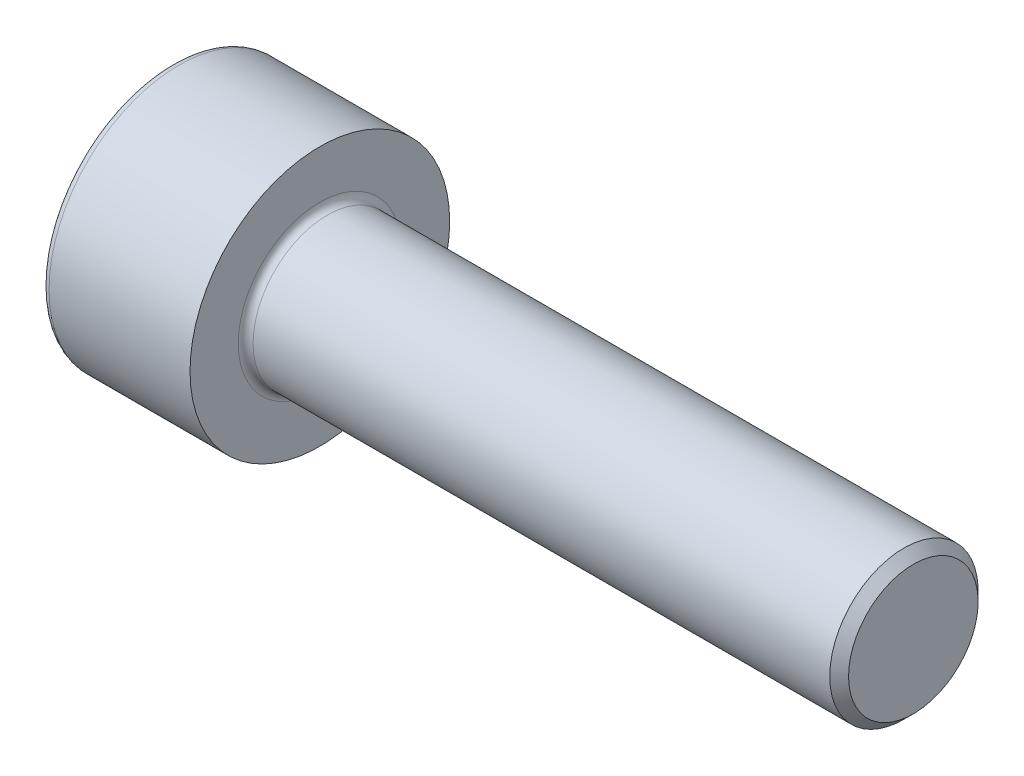
ISO-10303-21;
HEADER;
FILE_DESCRIPTION(('STEP AP214'),'2;1');
FILE_NAME('part.step','',(''),(''),'','','');
FILE_SCHEMA(('AUTOMOTIVE_DESIGN { 1 0 10303 214 1 1 1 1 }'));
ENDSEC;
DATA;
#1=APPLICATION_CONTEXT('core data for automotive mechanical design processes');
#2=APPLICATION_PROTOCOL_DEFINITION('international standard','automotive_design',2000,#1);
#3=PRODUCT_CONTEXT('',#1,'mechanical');
#4=PRODUCT('Part','Part','',(#3));
#5=PRODUCT_RELATED_PRODUCT_CATEGORY('part','',(#4));
#6=PRODUCT_DEFINITION_FORMATION('','',#4);
#7=PRODUCT_DEFINITION_CONTEXT('part definition',#1,'design');
#8=PRODUCT_DEFINITION('design','',#6,#7);
#9=PRODUCT_DEFINITION_SHAPE('','',#8);
#10=(LENGTH_UNIT() NAMED_UNIT(*) SI_UNIT(.MILLI.,.METRE.));
#11=(NAMED_UNIT(*) PLANE_ANGLE_UNIT() SI_UNIT($,.RADIAN.));
#12=(NAMED_UNIT(*) SI_UNIT($,.STERADIAN.) SOLID_ANGLE_UNIT());
#13=UNCERTAINTY_MEASURE_WITH_UNIT(LENGTH_MEASURE(1.E-05),#10,'distance_accuracy_value','');
#14=(GEOMETRIC_REPRESENTATION_CONTEXT(3) GLOBAL_UNCERTAINTY_ASSIGNED_CONTEXT((#13)) GLOBAL_UNIT_ASSIGNED_CONTEXT((#10,
#11,#12)) REPRESENTATION_CONTEXT('',''));
#15=CARTESIAN_POINT('',(0.,0.,0.));
#16=DIRECTION('',(0.,0.,1.));
#17=DIRECTION('',(1.,0.,0.));
#18=AXIS2_PLACEMENT_3D('',#15,#16,#17);
#19=CARTESIAN_POINT('',(16.,0.,0.));
#20=DIRECTION('',(-1.,0.,0.));
#21=DIRECTION('',(0.,0.,1.));
#22=AXIS2_PLACEMENT_3D('',#19,#20,#21);
#23=CONICAL_SURFACE('',#22,1.7464999999935,0.785398163397448);
#24=CARTESIAN_POINT('',(15.7464999999935,0.,0.));
#25=DIRECTION('',(-1.,0.,0.));
#26=DIRECTION('',(0.,0.,1.));
#27=AXIS2_PLACEMENT_3D('',#24,#25,#26);
#28=CIRCLE('',#27,2.);
#29=CARTESIAN_POINT('',(15.7464999999935,0.,2.));
#30=VERTEX_POINT('',#29);
#31=EDGE_CURVE('E11',#30,#30,#28,.T.);
#32=ORIENTED_EDGE('',*,*,#31,.F.);
#33=EDGE_LOOP('',(#32));
#34=FACE_BOUND('',#33,.T.);
#35=CARTESIAN_POINT('',(16.,0.,0.));
#36=DIRECTION('',(-1.,0.,0.));
#37=DIRECTION('',(0.,0.,1.));
#38=AXIS2_PLACEMENT_3D('',#35,#36,#37);
#39=CIRCLE('',#38,1.7464999999935);
#40=CARTESIAN_POINT('',(16.,0.,1.7464999999935));
#41=VERTEX_POINT('',#40);
#42=EDGE_CURVE('E134',#41,#41,#39,.T.);
#43=ORIENTED_EDGE('',*,*,#42,.T.);
#44=EDGE_LOOP('',(#43));
#45=FACE_BOUND('',#44,.T.);
#46=ADVANCED_FACE('F33',(#34,#45),#23,.T.);
#47=CARTESIAN_POINT('',(-4.,0.,0.));
#48=DIRECTION('',(-1.,0.,0.));
#49=DIRECTION('',(0.,0.,1.));
#50=AXIS2_PLACEMENT_3D('',#47,#48,#49);
#51=CYLINDRICAL_SURFACE('',#50,2.);
#52=CARTESIAN_POINT('',(0.200000000000001,0.,0.));
#53=DIRECTION('',(-1.,0.,0.));
#54=DIRECTION('',(0.,0.,1.));
#55=AXIS2_PLACEMENT_3D('',#52,#53,#54);
#56=CIRCLE('',#55,2.);
#57=CARTESIAN_POINT('',(0.200000000000001,0.,2.));
#58=VERTEX_POINT('',#57);
#59=EDGE_CURVE('E40',#58,#58,#56,.T.);
#60=ORIENTED_EDGE('',*,*,#59,.F.);
#61=EDGE_LOOP('',(#60));
#62=FACE_BOUND('',#61,.T.);
#63=ORIENTED_EDGE('',*,*,#31,.T.);
#64=EDGE_LOOP('',(#63));
#65=FACE_BOUND('',#64,.T.);
#66=ADVANCED_FACE('F158',(#62,#65),#51,.T.);
#67=CARTESIAN_POINT('',(0.2,0.,0.));
#68=DIRECTION('',(-1.,0.,0.));
#69=DIRECTION('',(0.,0.,1.));
#70=AXIS2_PLACEMENT_3D('',#67,#68,#69);
#71=TOROIDAL_SURFACE('',#70,2.2,0.2);
#72=CARTESIAN_POINT('',(0.,0.,0.));
#73=DIRECTION('',(-1.,0.,0.));
#74=DIRECTION('',(0.,0.,1.));
#75=AXIS2_PLACEMENT_3D('',#72,#73,#74);
#76=CIRCLE('',#75,2.2);
#77=CARTESIAN_POINT('',(0.,0.,2.2));
#78=VERTEX_POINT('',#77);
#79=EDGE_CURVE('E151',#78,#78,#76,.T.);
#80=ORIENTED_EDGE('',*,*,#79,.F.);
#81=EDGE_LOOP('',(#80));
#82=FACE_BOUND('',#81,.T.);
#83=ORIENTED_EDGE('',*,*,#59,.T.);
#84=EDGE_LOOP('',(#83));
#85=FACE_BOUND('',#84,.T.);
#86=ADVANCED_FACE('F156',(#82,#85),#71,.F.);
#87=CARTESIAN_POINT('',(0.,2.2,0.));
#88=DIRECTION('',(-1.,0.,0.));
#89=DIRECTION('',(0.,0.,1.));
#90=AXIS2_PLACEMENT_3D('',#87,#88,#89);
#91=PLANE('',#90);
#92=CARTESIAN_POINT('',(0.,0.,0.));
#93=DIRECTION('',(-1.,0.,0.));
#94=DIRECTION('',(0.,0.,1.));
#95=AXIS2_PLACEMENT_3D('',#92,#93,#94);
#96=CIRCLE('',#95,3.5);
#97=CARTESIAN_POINT('',(0.,0.,3.5));
#98=VERTEX_POINT('',#97);
#99=EDGE_CURVE('E148',#98,#98,#96,.T.);
#100=ORIENTED_EDGE('',*,*,#99,.F.);
#101=EDGE_LOOP('',(#100));
#102=FACE_BOUND('',#101,.T.);
#103=ORIENTED_EDGE('',*,*,#79,.T.);
#104=EDGE_LOOP('',(#103));
#105=FACE_BOUND('',#104,.T.);
#106=ADVANCED_FACE('F189',(#102,#105),#91,.F.);
#107=CARTESIAN_POINT('',(-4.,0.,0.));
#108=DIRECTION('',(-1.,0.,0.));
#109=DIRECTION('',(0.,0.,1.));
#110=AXIS2_PLACEMENT_3D('',#107,#108,#109);
#111=CYLINDRICAL_SURFACE('',#110,3.5);
#112=CARTESIAN_POINT('',(-3.8,0.,0.));
#113=DIRECTION('',(-1.,0.,0.));
#114=DIRECTION('',(0.,0.,1.));
#115=AXIS2_PLACEMENT_3D('',#112,#113,#114);
#116=CIRCLE('',#115,3.5);
#117=CARTESIAN_POINT('',(-3.8,0.,3.5));
#118=VERTEX_POINT('',#117);
#119=EDGE_CURVE('E145',#118,#118,#116,.T.);
#120=ORIENTED_EDGE('',*,*,#119,.F.);
#121=EDGE_LOOP('',(#120));
#122=FACE_BOUND('',#121,.T.);
#123=ORIENTED_EDGE('',*,*,#99,.T.);
#124=EDGE_LOOP('',(#123));
#125=FACE_BOUND('',#124,.T.);
#126=ADVANCED_FACE('F185',(#122,#125),#111,.T.);
#127=CARTESIAN_POINT('',(-3.8,0.,0.));
#128=DIRECTION('',(-1.,0.,0.));
#129=DIRECTION('',(0.,0.,1.));
#130=AXIS2_PLACEMENT_3D('',#127,#128,#129);
#131=TOROIDAL_SURFACE('',#130,3.3,0.200000000000001);
#132=CARTESIAN_POINT('',(-4.,0.,0.));
#133=DIRECTION('',(-1.,0.,0.));
#134=DIRECTION('',(0.,0.,1.));
#135=AXIS2_PLACEMENT_3D('',#132,#133,#134);
#136=CIRCLE('',#135,3.3);
#137=CARTESIAN_POINT('',(-4.,0.,3.3));
#138=VERTEX_POINT('',#137);
#139=EDGE_CURVE('E142',#138,#138,#136,.T.);
#140=ORIENTED_EDGE('',*,*,#139,.F.);
#141=EDGE_LOOP('',(#140));
#142=FACE_BOUND('',#141,.T.);
#143=ORIENTED_EDGE('',*,*,#119,.T.);
#144=EDGE_LOOP('',(#143));
#145=FACE_BOUND('',#144,.T.);
#146=ADVANCED_FACE('F178',(#142,#145),#131,.T.);
#147=CARTESIAN_POINT('',(-4.,3.3,0.));
#148=DIRECTION('',(1.,0.,0.));
#149=DIRECTION('',(0.,0.,-1.));
#150=AXIS2_PLACEMENT_3D('',#147,#148,#149);
#151=PLANE('',#150);
#152=DIRECTION('',(0.,0.5,-0.866025403784438));
#153=VECTOR('',#152,1.);
#154=CARTESIAN_POINT('',(-4.,0.886232663206076,1.535));
#155=LINE('',#154,#153);
#156=CARTESIAN_POINT('',(-4.,0.886232663206076,1.535));
#157=VERTEX_POINT('',#156);
#158=CARTESIAN_POINT('',(-4.,1.77246532641215,0.));
#159=VERTEX_POINT('',#158);
#160=EDGE_CURVE('E121',#157,#159,#155,.T.);
#161=ORIENTED_EDGE('',*,*,#160,.F.);
#162=DIRECTION('',(0.,1.,0.));
#163=VECTOR('',#162,1.);
#164=CARTESIAN_POINT('',(-4.,-0.886232663206076,1.535));
#165=LINE('',#164,#163);
#166=CARTESIAN_POINT('',(-4.,-0.886232663206076,1.535));
#167=VERTEX_POINT('',#166);
#168=EDGE_CURVE('E47',#167,#157,#165,.T.);
#169=ORIENTED_EDGE('',*,*,#168,.F.);
#170=DIRECTION('',(0.,0.5,0.866025403784439));
#171=VECTOR('',#170,1.);
#172=CARTESIAN_POINT('',(-4.,-1.77246532641215,0.));
#173=LINE('',#172,#171);
#174=CARTESIAN_POINT('',(-4.,-1.77246532641215,0.));
#175=VERTEX_POINT('',#174);
#176=EDGE_CURVE('E130',#175,#167,#173,.T.);
#177=ORIENTED_EDGE('',*,*,#176,.F.);
#178=DIRECTION('',(0.,-0.5,0.866025403784439));
#179=VECTOR('',#178,1.);
#180=CARTESIAN_POINT('',(-4.,-0.886232663206076,-1.535));
#181=LINE('',#180,#179);
#182=CARTESIAN_POINT('',(-4.,-0.886232663206076,-1.535));
#183=VERTEX_POINT('',#182);
#184=EDGE_CURVE('E128',#183,#175,#181,.T.);
#185=ORIENTED_EDGE('',*,*,#184,.F.);
#186=DIRECTION('',(0.,-1.,0.));
#187=VECTOR('',#186,1.);
#188=CARTESIAN_POINT('',(-4.,0.886232663206076,-1.535));
#189=LINE('',#188,#187);
#190=CARTESIAN_POINT('',(-4.,0.886232663206076,-1.535));
#191=VERTEX_POINT('',#190);
#192=EDGE_CURVE('E95',#191,#183,#189,.T.);
#193=ORIENTED_EDGE('',*,*,#192,.F.);
#194=DIRECTION('',(0.,-0.5,-0.866025403784439));
#195=VECTOR('',#194,1.);
#196=CARTESIAN_POINT('',(-4.,1.77246532641215,0.));
#197=LINE('',#196,#195);
#198=EDGE_CURVE('E124',#159,#191,#197,.T.);
#199=ORIENTED_EDGE('',*,*,#198,.F.);
#200=EDGE_LOOP('',(#161,#169,#177,#185,#193,#199));
#201=FACE_BOUND('',#200,.T.);
#202=ORIENTED_EDGE('',*,*,#139,.T.);
#203=EDGE_LOOP('',(#202));
#204=FACE_BOUND('',#203,.T.);
#205=ADVANCED_FACE('F170',(#201,#204),#151,.F.);
#206=CARTESIAN_POINT('',(16.,1.7464999999935,0.));
#207=DIRECTION('',(-1.,0.,0.));
#208=DIRECTION('',(0.,0.,1.));
#209=AXIS2_PLACEMENT_3D('',#206,#207,#208);
#210=PLANE('',#209);
#211=ORIENTED_EDGE('',*,*,#42,.F.);
#212=EDGE_LOOP('',(#211));
#213=FACE_BOUND('',#212,.T.);
#214=ADVANCED_FACE('F167',(#213),#210,.F.);
#215=CARTESIAN_POINT('',(-2.,-0.886232663206076,1.535));
#216=DIRECTION('',(0.,0.,1.));
#217=DIRECTION('',(1.,0.,0.));
#218=AXIS2_PLACEMENT_3D('',#215,#216,#217);
#219=PLANE('',#218);
#220=ORIENTED_EDGE('',*,*,#168,.T.);
#221=DIRECTION('',(-1.,0.,0.));
#222=VECTOR('',#221,1.);
#223=CARTESIAN_POINT('',(-2.,0.886232663206076,1.535));
#224=LINE('',#223,#222);
#225=CARTESIAN_POINT('',(-2.,0.886232663206076,1.535));
#226=VERTEX_POINT('',#225);
#227=EDGE_CURVE('E77',#226,#157,#224,.T.);
#228=ORIENTED_EDGE('',*,*,#227,.F.);
#229=DIRECTION('',(0.,1.,0.));
#230=VECTOR('',#229,1.);
#231=CARTESIAN_POINT('',(-2.,-0.886232663206076,1.535));
#232=LINE('',#231,#230);
#233=CARTESIAN_POINT('',(-2.,-0.886232663206076,1.535));
#234=VERTEX_POINT('',#233);
#235=EDGE_CURVE('E132',#234,#226,#232,.T.);
#236=ORIENTED_EDGE('',*,*,#235,.F.);
#237=DIRECTION('',(-1.,0.,0.));
#238=VECTOR('',#237,1.);
#239=CARTESIAN_POINT('',(-2.,-0.886232663206076,1.535));
#240=LINE('',#239,#238);
#241=EDGE_CURVE('E55',#234,#167,#240,.T.);
#242=ORIENTED_EDGE('',*,*,#241,.T.);
#243=EDGE_LOOP('',(#220,#228,#236,#242));
#244=FACE_BOUND('',#243,.T.);
#245=ADVANCED_FACE('F169',(#244),#219,.F.);
#246=CARTESIAN_POINT('',(-2.,-1.77246532641215,0.));
#247=DIRECTION('',(0.,-0.866025403784439,0.5));
#248=DIRECTION('',(0.,-0.5,-0.866025403784439));
#249=AXIS2_PLACEMENT_3D('',#246,#247,#248);
#250=PLANE('',#249);
#251=ORIENTED_EDGE('',*,*,#176,.T.);
#252=ORIENTED_EDGE('',*,*,#241,.F.);
#253=DIRECTION('',(0.,0.5,0.866025403784439));
#254=VECTOR('',#253,1.);
#255=CARTESIAN_POINT('',(-2.,-1.77246532641215,0.));
#256=LINE('',#255,#254);
#257=CARTESIAN_POINT('',(-2.,-1.77246532641215,0.));
#258=VERTEX_POINT('',#257);
#259=EDGE_CURVE('E107',#258,#234,#256,.T.);
#260=ORIENTED_EDGE('',*,*,#259,.F.);
#261=DIRECTION('',(-1.,0.,0.));
#262=VECTOR('',#261,1.);
#263=CARTESIAN_POINT('',(-2.,-1.77246532641215,0.));
#264=LINE('',#263,#262);
#265=EDGE_CURVE('E99',#258,#175,#264,.T.);
#266=ORIENTED_EDGE('',*,*,#265,.T.);
#267=EDGE_LOOP('',(#251,#252,#260,#266));
#268=FACE_BOUND('',#267,.T.);
#269=ADVANCED_FACE('F176',(#268),#250,.F.);
#270=CARTESIAN_POINT('',(-2.,-0.886232663206076,-1.535));
#271=DIRECTION('',(0.,-0.866025403784439,-0.5));
#272=DIRECTION('',(0.,0.5,-0.866025403784439));
#273=AXIS2_PLACEMENT_3D('',#270,#271,#272);
#274=PLANE('',#273);
#275=ORIENTED_EDGE('',*,*,#184,.T.);
#276=ORIENTED_EDGE('',*,*,#265,.F.);
#277=DIRECTION('',(0.,-0.5,0.866025403784439));
#278=VECTOR('',#277,1.);
#279=CARTESIAN_POINT('',(-2.,-0.886232663206076,-1.535));
#280=LINE('',#279,#278);
#281=CARTESIAN_POINT('',(-2.,-0.886232663206076,-1.535));
#282=VERTEX_POINT('',#281);
#283=EDGE_CURVE('E103',#282,#258,#280,.T.);
#284=ORIENTED_EDGE('',*,*,#283,.F.);
#285=DIRECTION('',(-1.,0.,0.));
#286=VECTOR('',#285,1.);
#287=CARTESIAN_POINT('',(-2.,-0.886232663206076,-1.535));
#288=LINE('',#287,#286);
#289=EDGE_CURVE('E88',#282,#183,#288,.T.);
#290=ORIENTED_EDGE('',*,*,#289,.T.);
#291=EDGE_LOOP('',(#275,#276,#284,#290));
#292=FACE_BOUND('',#291,.T.);
#293=ADVANCED_FACE('F104',(#292),#274,.F.);
#294=CARTESIAN_POINT('',(-2.,0.886232663206076,-1.535));
#295=DIRECTION('',(0.,0.,-1.));
#296=DIRECTION('',(0.,1.,0.));
#297=AXIS2_PLACEMENT_3D('',#294,#295,#296);
#298=PLANE('',#297);
#299=ORIENTED_EDGE('',*,*,#192,.T.);
#300=ORIENTED_EDGE('',*,*,#289,.F.);
#301=DIRECTION('',(0.,-1.,0.));
#302=VECTOR('',#301,1.);
#303=CARTESIAN_POINT('',(-2.,0.886232663206076,-1.535));
#304=LINE('',#303,#302);
#305=CARTESIAN_POINT('',(-2.,0.886232663206076,-1.535));
#306=VERTEX_POINT('',#305);
#307=EDGE_CURVE('E92',#306,#282,#304,.T.);
#308=ORIENTED_EDGE('',*,*,#307,.F.);
#309=DIRECTION('',(-1.,0.,0.));
#310=VECTOR('',#309,1.);
#311=CARTESIAN_POINT('',(-2.,0.886232663206076,-1.535));
#312=LINE('',#311,#310);
#313=EDGE_CURVE('E100',#306,#191,#312,.T.);
#314=ORIENTED_EDGE('',*,*,#313,.T.);
#315=EDGE_LOOP('',(#299,#300,#308,#314));
#316=FACE_BOUND('',#315,.T.);
#317=ADVANCED_FACE('F90',(#316),#298,.F.);
#318=CARTESIAN_POINT('',(-2.,1.77246532641215,0.));
#319=DIRECTION('',(0.,0.866025403784439,-0.5));
#320=DIRECTION('',(0.,0.5,0.866025403784439));
#321=AXIS2_PLACEMENT_3D('',#318,#319,#320);
#322=PLANE('',#321);
#323=ORIENTED_EDGE('',*,*,#198,.T.);
#324=ORIENTED_EDGE('',*,*,#313,.F.);
#325=DIRECTION('',(0.,-0.5,-0.866025403784439));
#326=VECTOR('',#325,1.);
#327=CARTESIAN_POINT('',(-2.,1.77246532641215,0.));
#328=LINE('',#327,#326);
#329=CARTESIAN_POINT('',(-2.,1.77246532641215,0.));
#330=VERTEX_POINT('',#329);
#331=EDGE_CURVE('E113',#330,#306,#328,.T.);
#332=ORIENTED_EDGE('',*,*,#331,.F.);
#333=DIRECTION('',(-1.,0.,0.));
#334=VECTOR('',#333,1.);
#335=CARTESIAN_POINT('',(-2.,1.77246532641215,0.));
#336=LINE('',#335,#334);
#337=EDGE_CURVE('E137',#330,#159,#336,.T.);
#338=ORIENTED_EDGE('',*,*,#337,.T.);
#339=EDGE_LOOP('',(#323,#324,#332,#338));
#340=FACE_BOUND('',#339,.T.);
#341=ADVANCED_FACE('F251',(#340),#322,.F.);
#342=CARTESIAN_POINT('',(-2.,0.886232663206076,1.535));
#343=DIRECTION('',(0.,0.866025403784439,0.5));
#344=DIRECTION('',(0.,-0.5,0.866025403784438));
#345=AXIS2_PLACEMENT_3D('',#342,#343,#344);
#346=PLANE('',#345);
#347=ORIENTED_EDGE('',*,*,#160,.T.);
#348=ORIENTED_EDGE('',*,*,#337,.F.);
#349=DIRECTION('',(0.,0.5,-0.866025403784438));
#350=VECTOR('',#349,1.);
#351=CARTESIAN_POINT('',(-2.,0.886232663206076,1.535));
#352=LINE('',#351,#350);
#353=EDGE_CURVE('E115',#226,#330,#352,.T.);
#354=ORIENTED_EDGE('',*,*,#353,.F.);
#355=ORIENTED_EDGE('',*,*,#227,.T.);
#356=EDGE_LOOP('',(#347,#348,#354,#355));
#357=FACE_BOUND('',#356,.T.);
#358=ADVANCED_FACE('F260',(#357),#346,.F.);
#359=CARTESIAN_POINT('',(-2.,0.,0.));
#360=DIRECTION('',(-1.,0.,0.));
#361=DIRECTION('',(0.,0.,1.));
#362=AXIS2_PLACEMENT_3D('',#359,#360,#361);
#363=PLANE('',#362);
#364=ORIENTED_EDGE('',*,*,#235,.T.);
#365=ORIENTED_EDGE('',*,*,#353,.T.);
#366=ORIENTED_EDGE('',*,*,#331,.T.);
#367=ORIENTED_EDGE('',*,*,#307,.T.);
#368=ORIENTED_EDGE('',*,*,#283,.T.);
#369=ORIENTED_EDGE('',*,*,#259,.T.);
#370=EDGE_LOOP('',(#364,#365,#366,#367,#368,#369));
#371=FACE_BOUND('',#370,.T.);
#372=ADVANCED_FACE('F110',(#371),#363,.T.);
#373=CLOSED_SHELL('',(#46,#66,#86,#106,#126,#146,#205,#214,#245,#269,#293,#317,#341,#358,#372));
#374=MANIFOLD_SOLID_BREP('B2',#373);
#375=ADVANCED_BREP_SHAPE_REPRESENTATION('',(#18,#374),#14);
#376=SHAPE_DEFINITION_REPRESENTATION(#9,#375);
ENDSEC;
END-ISO-10303-21;
